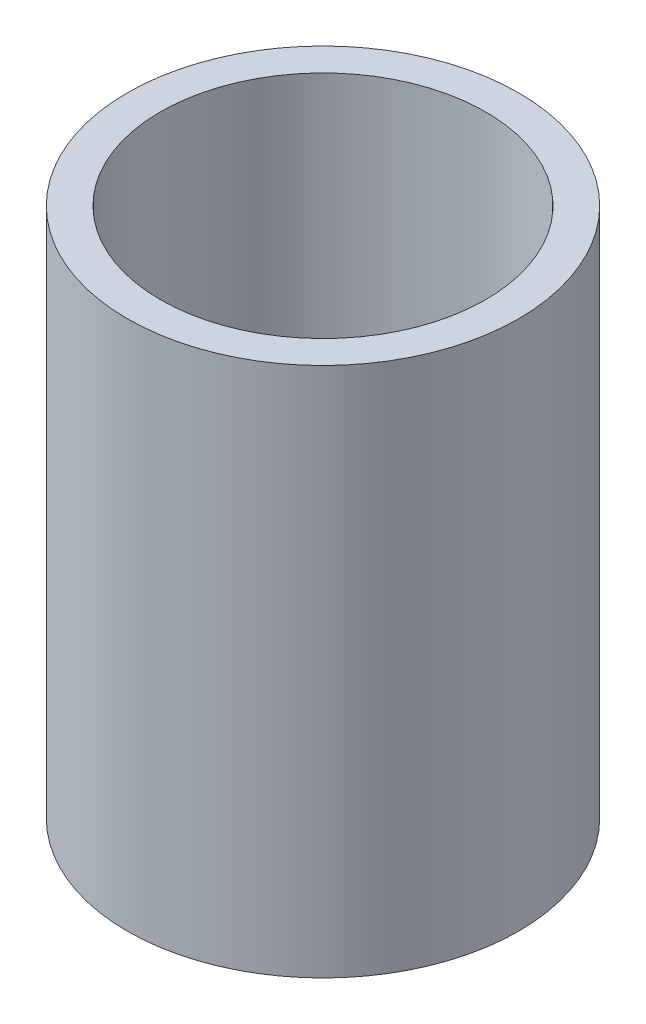
ISO-10303-21;
HEADER;
FILE_DESCRIPTION(('STEP AP214'),'2;1');
FILE_NAME('part.step','',(''),(''),'','','');
FILE_SCHEMA(('AUTOMOTIVE_DESIGN { 1 0 10303 214 1 1 1 1 }'));
ENDSEC;
DATA;
#1=APPLICATION_CONTEXT('core data for automotive mechanical design processes');
#2=APPLICATION_PROTOCOL_DEFINITION('international standard','automotive_design',2000,#1);
#3=PRODUCT_CONTEXT('',#1,'mechanical');
#4=PRODUCT('Part','Part','',(#3));
#5=PRODUCT_RELATED_PRODUCT_CATEGORY('part','',(#4));
#6=PRODUCT_DEFINITION_FORMATION('','',#4);
#7=PRODUCT_DEFINITION_CONTEXT('part definition',#1,'design');
#8=PRODUCT_DEFINITION('design','',#6,#7);
#9=PRODUCT_DEFINITION_SHAPE('','',#8);
#10=(LENGTH_UNIT() NAMED_UNIT(*) SI_UNIT(.MILLI.,.METRE.));
#11=(NAMED_UNIT(*) PLANE_ANGLE_UNIT() SI_UNIT($,.RADIAN.));
#12=(NAMED_UNIT(*) SI_UNIT($,.STERADIAN.) SOLID_ANGLE_UNIT());
#13=UNCERTAINTY_MEASURE_WITH_UNIT(LENGTH_MEASURE(1.E-05),#10,'distance_accuracy_value','');
#14=(GEOMETRIC_REPRESENTATION_CONTEXT(3) GLOBAL_UNCERTAINTY_ASSIGNED_CONTEXT((#13)) GLOBAL_UNIT_ASSIGNED_CONTEXT((#10,
#11,#12)) REPRESENTATION_CONTEXT('',''));
#15=CARTESIAN_POINT('',(0.,0.,0.));
#16=DIRECTION('',(0.,0.,1.));
#17=DIRECTION('',(1.,0.,0.));
#18=AXIS2_PLACEMENT_3D('',#15,#16,#17);
#19=CARTESIAN_POINT('',(0.,57.15,0.));
#20=DIRECTION('',(0.,1.,0.));
#21=DIRECTION('',(0.,0.,1.));
#22=AXIS2_PLACEMENT_3D('',#19,#20,#21);
#23=PLANE('',#22);
#24=CARTESIAN_POINT('',(0.,57.15,0.));
#25=DIRECTION('',(0.,1.,0.));
#26=DIRECTION('',(0.,0.,1.));
#27=AXIS2_PLACEMENT_3D('',#24,#25,#26);
#28=CIRCLE('',#27,21.082);
#29=CARTESIAN_POINT('',(0.,57.15,21.082));
#30=VERTEX_POINT('',#29);
#31=EDGE_CURVE('E10',#30,#30,#28,.T.);
#32=ORIENTED_EDGE('',*,*,#31,.T.);
#33=EDGE_LOOP('',(#32));
#34=FACE_BOUND('',#33,.T.);
#35=CARTESIAN_POINT('',(0.,57.15,0.));
#36=DIRECTION('',(0.,1.,0.));
#37=DIRECTION('',(0.,0.,1.));
#38=AXIS2_PLACEMENT_3D('',#35,#36,#37);
#39=CIRCLE('',#38,17.526);
#40=CARTESIAN_POINT('',(0.,57.15,17.526));
#41=VERTEX_POINT('',#40);
#42=EDGE_CURVE('E50',#41,#41,#39,.T.);
#43=ORIENTED_EDGE('',*,*,#42,.F.);
#44=EDGE_LOOP('',(#43));
#45=FACE_BOUND('',#44,.T.);
#46=ADVANCED_FACE('F36',(#34,#45),#23,.T.);
#47=CARTESIAN_POINT('',(0.,0.,0.));
#48=DIRECTION('',(0.,1.,0.));
#49=DIRECTION('',(0.,0.,1.));
#50=AXIS2_PLACEMENT_3D('',#47,#48,#49);
#51=PLANE('',#50);
#52=CARTESIAN_POINT('',(0.,0.,0.));
#53=DIRECTION('',(0.,1.,0.));
#54=DIRECTION('',(0.,0.,1.));
#55=AXIS2_PLACEMENT_3D('',#52,#53,#54);
#56=CIRCLE('',#55,21.082);
#57=CARTESIAN_POINT('',(0.,0.,21.082));
#58=VERTEX_POINT('',#57);
#59=EDGE_CURVE('E40',#58,#58,#56,.T.);
#60=ORIENTED_EDGE('',*,*,#59,.F.);
#61=EDGE_LOOP('',(#60));
#62=FACE_BOUND('',#61,.T.);
#63=CARTESIAN_POINT('',(0.,0.,0.));
#64=DIRECTION('',(0.,1.,0.));
#65=DIRECTION('',(0.,0.,1.));
#66=AXIS2_PLACEMENT_3D('',#63,#64,#65);
#67=CIRCLE('',#66,17.526);
#68=CARTESIAN_POINT('',(0.,0.,17.526));
#69=VERTEX_POINT('',#68);
#70=EDGE_CURVE('E52',#69,#69,#67,.T.);
#71=ORIENTED_EDGE('',*,*,#70,.T.);
#72=EDGE_LOOP('',(#71));
#73=FACE_BOUND('',#72,.T.);
#74=ADVANCED_FACE('F65',(#62,#73),#51,.F.);
#75=CARTESIAN_POINT('',(0.,57.15,0.));
#76=DIRECTION('',(0.,-1.,0.));
#77=DIRECTION('',(0.,0.,-1.));
#78=AXIS2_PLACEMENT_3D('',#75,#76,#77);
#79=CYLINDRICAL_SURFACE('',#78,21.082);
#80=ORIENTED_EDGE('',*,*,#31,.F.);
#81=EDGE_LOOP('',(#80));
#82=FACE_BOUND('',#81,.T.);
#83=ORIENTED_EDGE('',*,*,#59,.T.);
#84=EDGE_LOOP('',(#83));
#85=FACE_BOUND('',#84,.T.);
#86=ADVANCED_FACE('F38',(#82,#85),#79,.T.);
#87=CARTESIAN_POINT('',(0.,57.15,0.));
#88=DIRECTION('',(0.,-1.,0.));
#89=DIRECTION('',(0.,0.,-1.));
#90=AXIS2_PLACEMENT_3D('',#87,#88,#89);
#91=CYLINDRICAL_SURFACE('',#90,17.526);
#92=ORIENTED_EDGE('',*,*,#42,.T.);
#93=EDGE_LOOP('',(#92));
#94=FACE_BOUND('',#93,.T.);
#95=ORIENTED_EDGE('',*,*,#70,.F.);
#96=EDGE_LOOP('',(#95));
#97=FACE_BOUND('',#96,.T.);
#98=ADVANCED_FACE('F61',(#94,#97),#91,.F.);
#99=CLOSED_SHELL('',(#46,#74,#86,#98));
#100=MANIFOLD_SOLID_BREP('B2',#99);
#101=ADVANCED_BREP_SHAPE_REPRESENTATION('',(#18,#100),#14);
#102=SHAPE_DEFINITION_REPRESENTATION(#9,#101);
ENDSEC;
END-ISO-10303-21;
